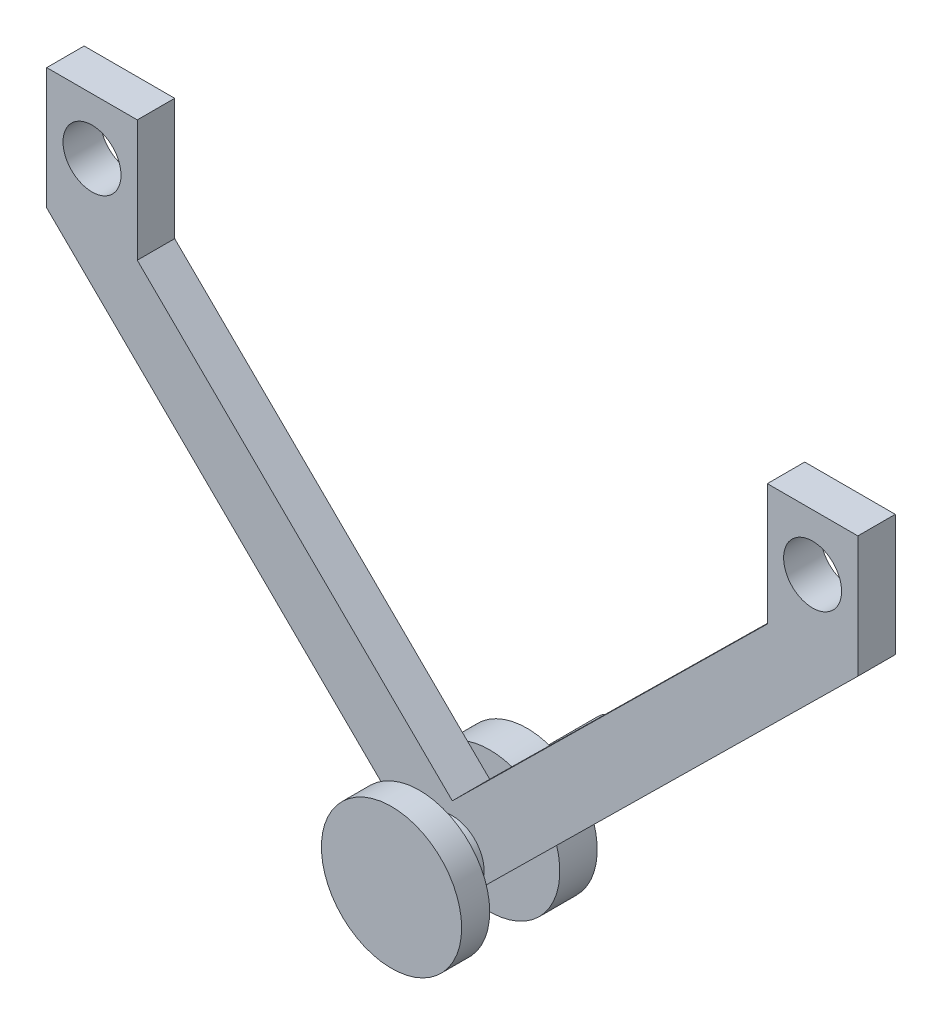
ISO-10303-21;
HEADER;
FILE_DESCRIPTION(('STEP AP214'),'2;1');
FILE_NAME('part.step','',(''),(''),'','','');
FILE_SCHEMA(('AUTOMOTIVE_DESIGN { 1 0 10303 214 1 1 1 1 }'));
ENDSEC;
DATA;
#1=APPLICATION_CONTEXT('core data for automotive mechanical design processes');
#2=APPLICATION_PROTOCOL_DEFINITION('international standard','automotive_design',2000,#1);
#3=PRODUCT_CONTEXT('',#1,'mechanical');
#4=PRODUCT('Part','Part','',(#3));
#5=PRODUCT_RELATED_PRODUCT_CATEGORY('part','',(#4));
#6=PRODUCT_DEFINITION_FORMATION('','',#4);
#7=PRODUCT_DEFINITION_CONTEXT('part definition',#1,'design');
#8=PRODUCT_DEFINITION('design','',#6,#7);
#9=PRODUCT_DEFINITION_SHAPE('','',#8);
#10=(LENGTH_UNIT() NAMED_UNIT(*) SI_UNIT(.MILLI.,.METRE.));
#11=(NAMED_UNIT(*) PLANE_ANGLE_UNIT() SI_UNIT($,.RADIAN.));
#12=(NAMED_UNIT(*) SI_UNIT($,.STERADIAN.) SOLID_ANGLE_UNIT());
#13=UNCERTAINTY_MEASURE_WITH_UNIT(LENGTH_MEASURE(1.E-05),#10,'distance_accuracy_value','');
#14=(GEOMETRIC_REPRESENTATION_CONTEXT(3) GLOBAL_UNCERTAINTY_ASSIGNED_CONTEXT((#13)) GLOBAL_UNIT_ASSIGNED_CONTEXT((#10,
#11,#12)) REPRESENTATION_CONTEXT('',''));
#15=CARTESIAN_POINT('',(0.,0.,0.));
#16=DIRECTION('',(0.,0.,1.));
#17=DIRECTION('',(1.,0.,0.));
#18=AXIS2_PLACEMENT_3D('',#15,#16,#17);
#19=CARTESIAN_POINT('',(0.,0.,-10.5));
#20=DIRECTION('',(0.,0.,-1.));
#21=DIRECTION('',(-1.,0.,0.));
#22=AXIS2_PLACEMENT_3D('',#19,#20,#21);
#23=PLANE('',#22);
#24=DIRECTION('',(0.712012665431887,-0.702166621440083,0.));
#25=VECTOR('',#24,1.);
#26=CARTESIAN_POINT('',(-2.38736651289628,-2.42084306246841,-10.5));
#27=LINE('',#26,#25);
#28=CARTESIAN_POINT('',(-7.14721245336703,2.27318150318781,-10.5));
#29=VERTEX_POINT('',#28);
#30=CARTESIAN_POINT('',(-2.38736651289628,-2.42084306246841,-10.5));
#31=VERTEX_POINT('',#30);
#32=EDGE_CURVE('E55',#29,#31,#27,.T.);
#33=ORIENTED_EDGE('',*,*,#32,.F.);
#34=CARTESIAN_POINT('',(0.,0.,-10.5));
#35=DIRECTION('',(0.,0.,-1.));
#36=DIRECTION('',(-1.,0.,0.));
#37=AXIS2_PLACEMENT_3D('',#34,#35,#36);
#38=CIRCLE('',#37,7.5);
#39=CARTESIAN_POINT('',(7.14721245336703,2.27318150318781,-10.5));
#40=VERTEX_POINT('',#39);
#41=EDGE_CURVE('E189',#40,#29,#38,.T.);
#42=ORIENTED_EDGE('',*,*,#41,.F.);
#43=DIRECTION('',(0.712012665431887,0.702166621440082,0.));
#44=VECTOR('',#43,1.);
#45=CARTESIAN_POINT('',(2.38736651289628,-2.42084306246841,-10.5));
#46=LINE('',#45,#44);
#47=CARTESIAN_POINT('',(2.38736651289628,-2.42084306246841,-10.5));
#48=VERTEX_POINT('',#47);
#49=EDGE_CURVE('E288',#48,#40,#46,.T.);
#50=ORIENTED_EDGE('',*,*,#49,.F.);
#51=CARTESIAN_POINT('',(0.,0.,-10.5));
#52=DIRECTION('',(0.,0.,-1.));
#53=DIRECTION('',(-1.,0.,0.));
#54=AXIS2_PLACEMENT_3D('',#51,#52,#53);
#55=CIRCLE('',#54,3.4);
#56=EDGE_CURVE('E183',#48,#31,#55,.T.);
#57=ORIENTED_EDGE('',*,*,#56,.T.);
#58=EDGE_LOOP('',(#33,#42,#50,#57));
#59=FACE_BOUND('',#58,.T.);
#60=ADVANCED_FACE('F45',(#59),#23,.F.);
#61=DIRECTION('',(-0.712012665431887,-0.702166621440083,0.));
#62=VECTOR('',#61,1.);
#63=CARTESIAN_POINT('',(-2.38736651289628,2.42084306246842,-10.5));
#64=LINE('',#63,#62);
#65=CARTESIAN_POINT('',(2.37247942757447,7.11486762812464,-10.5));
#66=VERTEX_POINT('',#65);
#67=CARTESIAN_POINT('',(0.,4.77519595516979,-10.5));
#68=VERTEX_POINT('',#67);
#69=EDGE_CURVE('E182',#66,#68,#64,.T.);
#70=ORIENTED_EDGE('',*,*,#69,.F.);
#71=CARTESIAN_POINT('',(-2.37247942757447,7.11486762812464,-10.5));
#72=VERTEX_POINT('',#71);
#73=EDGE_CURVE('E188',#72,#66,#38,.T.);
#74=ORIENTED_EDGE('',*,*,#73,.F.);
#75=DIRECTION('',(-0.712012665431887,0.702166621440082,0.));
#76=VECTOR('',#75,1.);
#77=CARTESIAN_POINT('',(0.,4.77519595516979,-10.5));
#78=LINE('',#77,#76);
#79=EDGE_CURVE('E241',#68,#72,#78,.T.);
#80=ORIENTED_EDGE('',*,*,#79,.F.);
#81=EDGE_LOOP('',(#70,#74,#80));
#82=FACE_BOUND('',#81,.T.);
#83=ADVANCED_FACE('F346',(#82),#23,.F.);
#84=CARTESIAN_POINT('',(0.,0.,-14.5));
#85=DIRECTION('',(0.,0.,1.));
#86=DIRECTION('',(1.,0.,0.));
#87=AXIS2_PLACEMENT_3D('',#84,#85,#86);
#88=CYLINDRICAL_SURFACE('',#87,3.4);
#89=CARTESIAN_POINT('',(0.,0.,-6.5));
#90=DIRECTION('',(0.,0.,1.));
#91=DIRECTION('',(1.,0.,0.));
#92=AXIS2_PLACEMENT_3D('',#89,#90,#91);
#93=CIRCLE('',#92,3.4);
#94=CARTESIAN_POINT('',(2.38736651289628,-2.42084306246841,-6.5));
#95=VERTEX_POINT('',#94);
#96=CARTESIAN_POINT('',(-2.38736651289628,-2.42084306246841,-6.5));
#97=VERTEX_POINT('',#96);
#98=EDGE_CURVE('E11',#95,#97,#93,.T.);
#99=ORIENTED_EDGE('',*,*,#98,.T.);
#100=DIRECTION('',(0.,0.,-1.));
#101=VECTOR('',#100,1.);
#102=CARTESIAN_POINT('',(-2.38736651289628,-2.42084306246841,-6.5));
#103=LINE('',#102,#101);
#104=EDGE_CURVE('E174',#97,#31,#103,.T.);
#105=ORIENTED_EDGE('',*,*,#104,.T.);
#106=ORIENTED_EDGE('',*,*,#56,.F.);
#107=DIRECTION('',(0.,0.,-1.));
#108=VECTOR('',#107,1.);
#109=CARTESIAN_POINT('',(2.38736651289628,-2.42084306246841,-6.5));
#110=LINE('',#109,#108);
#111=EDGE_CURVE('E65',#95,#48,#110,.T.);
#112=ORIENTED_EDGE('',*,*,#111,.F.);
#113=EDGE_LOOP('',(#99,#105,#106,#112));
#114=FACE_BOUND('',#113,.T.);
#115=CARTESIAN_POINT('',(0.,0.,-3.));
#116=DIRECTION('',(0.,0.,-1.));
#117=DIRECTION('',(-1.,0.,0.));
#118=AXIS2_PLACEMENT_3D('',#115,#116,#117);
#119=CIRCLE('',#118,3.4);
#120=CARTESIAN_POINT('',(-3.4,0.,-3.));
#121=VERTEX_POINT('',#120);
#122=EDGE_CURVE('E193',#121,#121,#119,.T.);
#123=ORIENTED_EDGE('',*,*,#122,.T.);
#124=EDGE_LOOP('',(#123));
#125=FACE_BOUND('',#124,.T.);
#126=ADVANCED_FACE('F282',(#114,#125),#88,.T.);
#127=CARTESIAN_POINT('',(0.,0.,-3.));
#128=DIRECTION('',(0.,0.,1.));
#129=DIRECTION('',(1.,0.,0.));
#130=AXIS2_PLACEMENT_3D('',#127,#128,#129);
#131=CYLINDRICAL_SURFACE('',#130,7.5);
#132=CARTESIAN_POINT('',(0.,0.,-3.));
#133=DIRECTION('',(0.,0.,1.));
#134=DIRECTION('',(1.,0.,0.));
#135=AXIS2_PLACEMENT_3D('',#132,#133,#134);
#136=CIRCLE('',#135,7.5);
#137=CARTESIAN_POINT('',(7.5,0.,-3.));
#138=VERTEX_POINT('',#137);
#139=EDGE_CURVE('E197',#138,#138,#136,.T.);
#140=ORIENTED_EDGE('',*,*,#139,.T.);
#141=EDGE_LOOP('',(#140));
#142=FACE_BOUND('',#141,.T.);
#143=CARTESIAN_POINT('',(0.,0.,0.));
#144=DIRECTION('',(0.,0.,1.));
#145=DIRECTION('',(1.,0.,0.));
#146=AXIS2_PLACEMENT_3D('',#143,#144,#145);
#147=CIRCLE('',#146,7.5);
#148=CARTESIAN_POINT('',(7.5,0.,0.));
#149=VERTEX_POINT('',#148);
#150=EDGE_CURVE('E187',#149,#149,#147,.T.);
#151=ORIENTED_EDGE('',*,*,#150,.F.);
#152=EDGE_LOOP('',(#151));
#153=FACE_BOUND('',#152,.T.);
#154=ADVANCED_FACE('F47',(#142,#153),#131,.T.);
#155=CARTESIAN_POINT('',(0.,0.,-3.));
#156=DIRECTION('',(0.,0.,1.));
#157=DIRECTION('',(1.,0.,0.));
#158=AXIS2_PLACEMENT_3D('',#155,#156,#157);
#159=PLANE('',#158);
#160=ORIENTED_EDGE('',*,*,#122,.F.);
#161=EDGE_LOOP('',(#160));
#162=FACE_BOUND('',#161,.T.);
#163=ORIENTED_EDGE('',*,*,#139,.F.);
#164=EDGE_LOOP('',(#163));
#165=FACE_BOUND('',#164,.T.);
#166=ADVANCED_FACE('F365',(#162,#165),#159,.F.);
#167=CARTESIAN_POINT('',(0.,0.,0.));
#168=DIRECTION('',(0.,0.,1.));
#169=DIRECTION('',(1.,0.,0.));
#170=AXIS2_PLACEMENT_3D('',#167,#168,#169);
#171=PLANE('',#170);
#172=ORIENTED_EDGE('',*,*,#150,.T.);
#173=EDGE_LOOP('',(#172));
#174=FACE_BOUND('',#173,.T.);
#175=ADVANCED_FACE('F361',(#174),#171,.T.);
#176=CARTESIAN_POINT('',(0.,0.,-10.5));
#177=DIRECTION('',(0.,0.,-1.));
#178=DIRECTION('',(-1.,0.,0.));
#179=AXIS2_PLACEMENT_3D('',#176,#177,#178);
#180=CYLINDRICAL_SURFACE('',#179,7.5);
#181=EDGE_CURVE('E184',#29,#72,#38,.T.);
#182=ORIENTED_EDGE('',*,*,#181,.T.);
#183=ORIENTED_EDGE('',*,*,#73,.T.);
#184=EDGE_CURVE('E228',#66,#40,#38,.T.);
#185=ORIENTED_EDGE('',*,*,#184,.T.);
#186=ORIENTED_EDGE('',*,*,#41,.T.);
#187=EDGE_LOOP('',(#182,#183,#185,#186));
#188=FACE_BOUND('',#187,.T.);
#189=CARTESIAN_POINT('',(0.,0.,-14.5));
#190=DIRECTION('',(0.,0.,-1.));
#191=DIRECTION('',(-1.,0.,0.));
#192=AXIS2_PLACEMENT_3D('',#189,#190,#191);
#193=CIRCLE('',#192,7.5);
#194=CARTESIAN_POINT('',(-7.5,0.,-14.5));
#195=VERTEX_POINT('',#194);
#196=EDGE_CURVE('E172',#195,#195,#193,.T.);
#197=ORIENTED_EDGE('',*,*,#196,.F.);
#198=EDGE_LOOP('',(#197));
#199=FACE_BOUND('',#198,.T.);
#200=ADVANCED_FACE('F223',(#188,#199),#180,.T.);
#201=CARTESIAN_POINT('',(0.,0.,-14.5));
#202=DIRECTION('',(0.,0.,-1.));
#203=DIRECTION('',(-1.,0.,0.));
#204=AXIS2_PLACEMENT_3D('',#201,#202,#203);
#205=PLANE('',#204);
#206=CARTESIAN_POINT('',(0.,0.,-14.5));
#207=DIRECTION('',(0.,0.,-1.));
#208=DIRECTION('',(-1.,0.,0.));
#209=AXIS2_PLACEMENT_3D('',#206,#207,#208);
#210=CIRCLE('',#209,3.4);
#211=CARTESIAN_POINT('',(-3.4,0.,-14.5));
#212=VERTEX_POINT('',#211);
#213=EDGE_CURVE('E178',#212,#212,#210,.T.);
#214=ORIENTED_EDGE('',*,*,#213,.F.);
#215=EDGE_LOOP('',(#214));
#216=FACE_BOUND('',#215,.T.);
#217=ORIENTED_EDGE('',*,*,#196,.T.);
#218=EDGE_LOOP('',(#217));
#219=FACE_BOUND('',#218,.T.);
#220=ADVANCED_FACE('F360',(#216,#219),#205,.T.);
#221=CARTESIAN_POINT('',(0.,0.,-24.5));
#222=DIRECTION('',(0.,0.,1.));
#223=DIRECTION('',(1.,0.,0.));
#224=AXIS2_PLACEMENT_3D('',#221,#222,#223);
#225=CYLINDRICAL_SURFACE('',#224,3.4);
#226=CARTESIAN_POINT('',(0.,0.,-24.5));
#227=DIRECTION('',(0.,0.,-1.));
#228=DIRECTION('',(-1.,0.,0.));
#229=AXIS2_PLACEMENT_3D('',#226,#227,#228);
#230=CIRCLE('',#229,3.4);
#231=CARTESIAN_POINT('',(-3.4,0.,-24.5));
#232=VERTEX_POINT('',#231);
#233=EDGE_CURVE('E167',#232,#232,#230,.T.);
#234=ORIENTED_EDGE('',*,*,#233,.F.);
#235=EDGE_LOOP('',(#234));
#236=FACE_BOUND('',#235,.T.);
#237=ORIENTED_EDGE('',*,*,#213,.T.);
#238=EDGE_LOOP('',(#237));
#239=FACE_BOUND('',#238,.T.);
#240=ADVANCED_FACE('F356',(#236,#239),#225,.T.);
#241=CARTESIAN_POINT('',(0.,0.,-24.5));
#242=DIRECTION('',(0.,0.,-1.));
#243=DIRECTION('',(-1.,0.,0.));
#244=AXIS2_PLACEMENT_3D('',#241,#242,#243);
#245=PLANE('',#244);
#246=ORIENTED_EDGE('',*,*,#233,.T.);
#247=EDGE_LOOP('',(#246));
#248=FACE_BOUND('',#247,.T.);
#249=ADVANCED_FACE('F498',(#248),#245,.T.);
#250=CARTESIAN_POINT('',(0.,0.,-10.5));
#251=DIRECTION('',(0.,0.,1.));
#252=DIRECTION('',(1.,0.,0.));
#253=AXIS2_PLACEMENT_3D('',#250,#251,#252);
#254=PLANE('',#253);
#255=CARTESIAN_POINT('',(-38.5328502669654,45.,-10.5));
#256=DIRECTION('',(0.,0.,-1.));
#257=DIRECTION('',(-1.,0.,0.));
#258=AXIS2_PLACEMENT_3D('',#255,#256,#257);
#259=CIRCLE('',#258,3.1);
#260=CARTESIAN_POINT('',(-41.6328502669654,45.,-10.5));
#261=VERTEX_POINT('',#260);
#262=EDGE_CURVE('E585',#261,#261,#259,.T.);
#263=ORIENTED_EDGE('',*,*,#262,.F.);
#264=EDGE_LOOP('',(#263));
#265=FACE_BOUND('',#264,.T.);
#266=ORIENTED_EDGE('',*,*,#181,.F.);
#267=DIRECTION('',(0.712012665431887,-0.702166621440082,0.));
#268=VECTOR('',#267,1.);
#269=CARTESIAN_POINT('',(-2.38736651289628,-2.42084306246841,-10.5));
#270=LINE('',#269,#268);
#271=CARTESIAN_POINT('',(-43.375005812649,38.,-10.5));
#272=VERTEX_POINT('',#271);
#273=EDGE_CURVE('E217',#272,#29,#270,.T.);
#274=ORIENTED_EDGE('',*,*,#273,.F.);
#275=DIRECTION('',(0.,-1.,0.));
#276=VECTOR('',#275,1.);
#277=CARTESIAN_POINT('',(-43.375005812649,38.,-10.5));
#278=LINE('',#277,#276);
#279=CARTESIAN_POINT('',(-43.375005812649,51.,-10.5));
#280=VERTEX_POINT('',#279);
#281=EDGE_CURVE('E316',#280,#272,#278,.T.);
#282=ORIENTED_EDGE('',*,*,#281,.F.);
#283=DIRECTION('',(-1.,0.,0.));
#284=VECTOR('',#283,1.);
#285=CARTESIAN_POINT('',(-43.375005812649,51.,-10.5));
#286=LINE('',#285,#284);
#287=CARTESIAN_POINT('',(-33.6906947212818,51.,-10.5));
#288=VERTEX_POINT('',#287);
#289=EDGE_CURVE('E165',#288,#280,#286,.T.);
#290=ORIENTED_EDGE('',*,*,#289,.F.);
#291=DIRECTION('',(0.,1.,0.));
#292=VECTOR('',#291,1.);
#293=CARTESIAN_POINT('',(-33.6906947212818,51.,-10.5));
#294=LINE('',#293,#292);
#295=CARTESIAN_POINT('',(-33.6906947212818,38.,-10.5));
#296=VERTEX_POINT('',#295);
#297=EDGE_CURVE('E161',#296,#288,#294,.T.);
#298=ORIENTED_EDGE('',*,*,#297,.F.);
#299=EDGE_CURVE('E235',#72,#296,#78,.T.);
#300=ORIENTED_EDGE('',*,*,#299,.F.);
#301=EDGE_LOOP('',(#266,#274,#282,#290,#298,#300));
#302=FACE_BOUND('',#301,.T.);
#303=ADVANCED_FACE('F233',(#265,#302),#254,.F.);
#304=CARTESIAN_POINT('',(-43.375005812649,51.,-6.5));
#305=DIRECTION('',(0.,-1.,0.));
#306=DIRECTION('',(0.,0.,-1.));
#307=AXIS2_PLACEMENT_3D('',#304,#305,#306);
#308=PLANE('',#307);
#309=ORIENTED_EDGE('',*,*,#289,.T.);
#310=DIRECTION('',(0.,0.,-1.));
#311=VECTOR('',#310,1.);
#312=CARTESIAN_POINT('',(-43.375005812649,51.,-6.5));
#313=LINE('',#312,#311);
#314=CARTESIAN_POINT('',(-43.375005812649,51.,-6.5));
#315=VERTEX_POINT('',#314);
#316=EDGE_CURVE('E143',#315,#280,#313,.T.);
#317=ORIENTED_EDGE('',*,*,#316,.F.);
#318=DIRECTION('',(-1.,0.,0.));
#319=VECTOR('',#318,1.);
#320=CARTESIAN_POINT('',(-43.375005812649,51.,-6.5));
#321=LINE('',#320,#319);
#322=CARTESIAN_POINT('',(-33.6906947212818,51.,-6.5));
#323=VERTEX_POINT('',#322);
#324=EDGE_CURVE('E151',#323,#315,#321,.T.);
#325=ORIENTED_EDGE('',*,*,#324,.F.);
#326=DIRECTION('',(0.,0.,-1.));
#327=VECTOR('',#326,1.);
#328=CARTESIAN_POINT('',(-33.6906947212818,51.,-6.5));
#329=LINE('',#328,#327);
#330=EDGE_CURVE('E256',#323,#288,#329,.T.);
#331=ORIENTED_EDGE('',*,*,#330,.T.);
#332=EDGE_LOOP('',(#309,#317,#325,#331));
#333=FACE_BOUND('',#332,.T.);
#334=ADVANCED_FACE('F163',(#333),#308,.F.);
#335=CARTESIAN_POINT('',(-43.375005812649,38.,-6.5));
#336=DIRECTION('',(1.,0.,0.));
#337=DIRECTION('',(0.,0.,-1.));
#338=AXIS2_PLACEMENT_3D('',#335,#336,#337);
#339=PLANE('',#338);
#340=ORIENTED_EDGE('',*,*,#281,.T.);
#341=DIRECTION('',(0.,0.,-1.));
#342=VECTOR('',#341,1.);
#343=CARTESIAN_POINT('',(-43.375005812649,38.,-6.5));
#344=LINE('',#343,#342);
#345=CARTESIAN_POINT('',(-43.375005812649,38.,-6.5));
#346=VERTEX_POINT('',#345);
#347=EDGE_CURVE('E146',#346,#272,#344,.T.);
#348=ORIENTED_EDGE('',*,*,#347,.F.);
#349=DIRECTION('',(0.,-1.,0.));
#350=VECTOR('',#349,1.);
#351=CARTESIAN_POINT('',(-43.375005812649,38.,-6.5));
#352=LINE('',#351,#350);
#353=EDGE_CURVE('E139',#315,#346,#352,.T.);
#354=ORIENTED_EDGE('',*,*,#353,.F.);
#355=ORIENTED_EDGE('',*,*,#316,.T.);
#356=EDGE_LOOP('',(#340,#348,#354,#355));
#357=FACE_BOUND('',#356,.T.);
#358=ADVANCED_FACE('F141',(#357),#339,.F.);
#359=CARTESIAN_POINT('',(-2.38736651289628,-2.42084306246841,-6.5));
#360=DIRECTION('',(0.702166621440083,0.712012665431887,0.));
#361=DIRECTION('',(-0.712012665431887,0.702166621440083,0.));
#362=AXIS2_PLACEMENT_3D('',#359,#360,#361);
#363=PLANE('',#362);
#364=ORIENTED_EDGE('',*,*,#273,.T.);
#365=ORIENTED_EDGE('',*,*,#32,.T.);
#366=ORIENTED_EDGE('',*,*,#104,.F.);
#367=DIRECTION('',(0.712012665431887,-0.702166621440082,0.));
#368=VECTOR('',#367,1.);
#369=CARTESIAN_POINT('',(-2.38736651289628,-2.42084306246841,-6.5));
#370=LINE('',#369,#368);
#371=EDGE_CURVE('E150',#346,#97,#370,.T.);
#372=ORIENTED_EDGE('',*,*,#371,.F.);
#373=ORIENTED_EDGE('',*,*,#347,.T.);
#374=EDGE_LOOP('',(#364,#365,#366,#372,#373));
#375=FACE_BOUND('',#374,.T.);
#376=ADVANCED_FACE('F215',(#375),#363,.F.);
#377=CARTESIAN_POINT('',(2.38736651289628,-2.42084306246841,-6.5));
#378=DIRECTION('',(-0.702166621440083,0.712012665431887,0.));
#379=DIRECTION('',(-0.712012665431887,-0.702166621440083,0.));
#380=AXIS2_PLACEMENT_3D('',#377,#378,#379);
#381=PLANE('',#380);
#382=ORIENTED_EDGE('',*,*,#49,.T.);
#383=CARTESIAN_POINT('',(43.375005812649,38.,-10.5));
#384=VERTEX_POINT('',#383);
#385=EDGE_CURVE('E321',#40,#384,#46,.T.);
#386=ORIENTED_EDGE('',*,*,#385,.T.);
#387=DIRECTION('',(0.,0.,-1.));
#388=VECTOR('',#387,1.);
#389=CARTESIAN_POINT('',(43.375005812649,38.,-6.5));
#390=LINE('',#389,#388);
#391=CARTESIAN_POINT('',(43.375005812649,38.,-6.5));
#392=VERTEX_POINT('',#391);
#393=EDGE_CURVE('E276',#392,#384,#390,.T.);
#394=ORIENTED_EDGE('',*,*,#393,.F.);
#395=DIRECTION('',(0.712012665431887,0.702166621440082,0.));
#396=VECTOR('',#395,1.);
#397=CARTESIAN_POINT('',(2.38736651289628,-2.42084306246841,-6.5));
#398=LINE('',#397,#396);
#399=EDGE_CURVE('E290',#95,#392,#398,.T.);
#400=ORIENTED_EDGE('',*,*,#399,.F.);
#401=ORIENTED_EDGE('',*,*,#111,.T.);
#402=EDGE_LOOP('',(#382,#386,#394,#400,#401));
#403=FACE_BOUND('',#402,.T.);
#404=ADVANCED_FACE('F287',(#403),#381,.F.);
#405=CARTESIAN_POINT('',(43.375005812649,38.,-6.5));
#406=DIRECTION('',(-1.,0.,0.));
#407=DIRECTION('',(0.,0.,1.));
#408=AXIS2_PLACEMENT_3D('',#405,#406,#407);
#409=PLANE('',#408);
#410=DIRECTION('',(0.,1.,0.));
#411=VECTOR('',#410,1.);
#412=CARTESIAN_POINT('',(43.375005812649,38.,-10.5));
#413=LINE('',#412,#411);
#414=CARTESIAN_POINT('',(43.375005812649,51.,-10.5));
#415=VERTEX_POINT('',#414);
#416=EDGE_CURVE('E324',#384,#415,#413,.T.);
#417=ORIENTED_EDGE('',*,*,#416,.T.);
#418=DIRECTION('',(0.,0.,-1.));
#419=VECTOR('',#418,1.);
#420=CARTESIAN_POINT('',(43.375005812649,51.,-6.5));
#421=LINE('',#420,#419);
#422=CARTESIAN_POINT('',(43.375005812649,51.,-6.5));
#423=VERTEX_POINT('',#422);
#424=EDGE_CURVE('E272',#423,#415,#421,.T.);
#425=ORIENTED_EDGE('',*,*,#424,.F.);
#426=DIRECTION('',(0.,1.,0.));
#427=VECTOR('',#426,1.);
#428=CARTESIAN_POINT('',(43.375005812649,38.,-6.5));
#429=LINE('',#428,#427);
#430=EDGE_CURVE('E293',#392,#423,#429,.T.);
#431=ORIENTED_EDGE('',*,*,#430,.F.);
#432=ORIENTED_EDGE('',*,*,#393,.T.);
#433=EDGE_LOOP('',(#417,#425,#431,#432));
#434=FACE_BOUND('',#433,.T.);
#435=ADVANCED_FACE('F442',(#434),#409,.F.);
#436=CARTESIAN_POINT('',(43.375005812649,51.,-6.5));
#437=DIRECTION('',(0.,-1.,0.));
#438=DIRECTION('',(0.,0.,-1.));
#439=AXIS2_PLACEMENT_3D('',#436,#437,#438);
#440=PLANE('',#439);
#441=DIRECTION('',(-1.,0.,0.));
#442=VECTOR('',#441,1.);
#443=CARTESIAN_POINT('',(43.375005812649,51.,-10.5));
#444=LINE('',#443,#442);
#445=CARTESIAN_POINT('',(33.6906947212818,51.,-10.5));
#446=VERTEX_POINT('',#445);
#447=EDGE_CURVE('E327',#415,#446,#444,.T.);
#448=ORIENTED_EDGE('',*,*,#447,.T.);
#449=DIRECTION('',(0.,0.,-1.));
#450=VECTOR('',#449,1.);
#451=CARTESIAN_POINT('',(33.6906947212818,51.,-6.5));
#452=LINE('',#451,#450);
#453=CARTESIAN_POINT('',(33.6906947212818,51.,-6.5));
#454=VERTEX_POINT('',#453);
#455=EDGE_CURVE('E268',#454,#446,#452,.T.);
#456=ORIENTED_EDGE('',*,*,#455,.F.);
#457=DIRECTION('',(-1.,0.,0.));
#458=VECTOR('',#457,1.);
#459=CARTESIAN_POINT('',(43.375005812649,51.,-6.5));
#460=LINE('',#459,#458);
#461=EDGE_CURVE('E297',#423,#454,#460,.T.);
#462=ORIENTED_EDGE('',*,*,#461,.F.);
#463=ORIENTED_EDGE('',*,*,#424,.T.);
#464=EDGE_LOOP('',(#448,#456,#462,#463));
#465=FACE_BOUND('',#464,.T.);
#466=ADVANCED_FACE('F450',(#465),#440,.F.);
#467=CARTESIAN_POINT('',(33.6906947212818,51.,-6.5));
#468=DIRECTION('',(1.,0.,0.));
#469=DIRECTION('',(0.,1.,0.));
#470=AXIS2_PLACEMENT_3D('',#467,#468,#469);
#471=PLANE('',#470);
#472=DIRECTION('',(0.,-1.,0.));
#473=VECTOR('',#472,1.);
#474=CARTESIAN_POINT('',(33.6906947212818,51.,-10.5));
#475=LINE('',#474,#473);
#476=CARTESIAN_POINT('',(33.6906947212818,38.,-10.5));
#477=VERTEX_POINT('',#476);
#478=EDGE_CURVE('E329',#446,#477,#475,.T.);
#479=ORIENTED_EDGE('',*,*,#478,.T.);
#480=DIRECTION('',(0.,0.,-1.));
#481=VECTOR('',#480,1.);
#482=CARTESIAN_POINT('',(33.6906947212818,38.,-6.5));
#483=LINE('',#482,#481);
#484=CARTESIAN_POINT('',(33.6906947212818,38.,-6.5));
#485=VERTEX_POINT('',#484);
#486=EDGE_CURVE('E264',#485,#477,#483,.T.);
#487=ORIENTED_EDGE('',*,*,#486,.F.);
#488=DIRECTION('',(0.,-1.,0.));
#489=VECTOR('',#488,1.);
#490=CARTESIAN_POINT('',(33.6906947212818,51.,-6.5));
#491=LINE('',#490,#489);
#492=EDGE_CURVE('E303',#454,#485,#491,.T.);
#493=ORIENTED_EDGE('',*,*,#492,.F.);
#494=ORIENTED_EDGE('',*,*,#455,.T.);
#495=EDGE_LOOP('',(#479,#487,#493,#494));
#496=FACE_BOUND('',#495,.T.);
#497=ADVANCED_FACE('F459',(#496),#471,.F.);
#498=CARTESIAN_POINT('',(0.,4.77519595516979,-6.5));
#499=DIRECTION('',(0.702166621440083,-0.712012665431887,0.));
#500=DIRECTION('',(0.712012665431887,0.702166621440083,0.));
#501=AXIS2_PLACEMENT_3D('',#498,#499,#500);
#502=PLANE('',#501);
#503=DIRECTION('',(-0.712012665431887,-0.702166621440082,0.));
#504=VECTOR('',#503,1.);
#505=CARTESIAN_POINT('',(0.,4.77519595516979,-10.5));
#506=LINE('',#505,#504);
#507=EDGE_CURVE('E242',#477,#66,#506,.T.);
#508=ORIENTED_EDGE('',*,*,#507,.T.);
#509=ORIENTED_EDGE('',*,*,#69,.T.);
#510=DIRECTION('',(0.,0.,-1.));
#511=VECTOR('',#510,1.);
#512=CARTESIAN_POINT('',(0.,4.77519595516979,-6.5));
#513=LINE('',#512,#511);
#514=CARTESIAN_POINT('',(0.,4.77519595516979,-6.5));
#515=VERTEX_POINT('',#514);
#516=EDGE_CURVE('E248',#515,#68,#513,.T.);
#517=ORIENTED_EDGE('',*,*,#516,.F.);
#518=DIRECTION('',(-0.712012665431887,-0.702166621440082,0.));
#519=VECTOR('',#518,1.);
#520=CARTESIAN_POINT('',(0.,4.77519595516979,-6.5));
#521=LINE('',#520,#519);
#522=EDGE_CURVE('E306',#485,#515,#521,.T.);
#523=ORIENTED_EDGE('',*,*,#522,.F.);
#524=ORIENTED_EDGE('',*,*,#486,.T.);
#525=EDGE_LOOP('',(#508,#509,#517,#523,#524));
#526=FACE_BOUND('',#525,.T.);
#527=ADVANCED_FACE('F338',(#526),#502,.F.);
#528=CARTESIAN_POINT('',(0.,4.77519595516979,-6.5));
#529=DIRECTION('',(-0.702166621440083,-0.712012665431887,0.));
#530=DIRECTION('',(0.712012665431887,-0.702166621440083,0.));
#531=AXIS2_PLACEMENT_3D('',#528,#529,#530);
#532=PLANE('',#531);
#533=ORIENTED_EDGE('',*,*,#79,.T.);
#534=ORIENTED_EDGE('',*,*,#299,.T.);
#535=DIRECTION('',(0.,0.,-1.));
#536=VECTOR('',#535,1.);
#537=CARTESIAN_POINT('',(-33.6906947212818,38.,-6.5));
#538=LINE('',#537,#536);
#539=CARTESIAN_POINT('',(-33.6906947212818,38.,-6.5));
#540=VERTEX_POINT('',#539);
#541=EDGE_CURVE('E259',#540,#296,#538,.T.);
#542=ORIENTED_EDGE('',*,*,#541,.F.);
#543=DIRECTION('',(-0.712012665431887,0.702166621440082,0.));
#544=VECTOR('',#543,1.);
#545=CARTESIAN_POINT('',(0.,4.77519595516979,-6.5));
#546=LINE('',#545,#544);
#547=EDGE_CURVE('E309',#515,#540,#546,.T.);
#548=ORIENTED_EDGE('',*,*,#547,.F.);
#549=ORIENTED_EDGE('',*,*,#516,.T.);
#550=EDGE_LOOP('',(#533,#534,#542,#548,#549));
#551=FACE_BOUND('',#550,.T.);
#552=ADVANCED_FACE('F245',(#551),#532,.F.);
#553=CARTESIAN_POINT('',(-33.6906947212818,51.,-6.5));
#554=DIRECTION('',(-1.,0.,0.));
#555=DIRECTION('',(0.,-1.,0.));
#556=AXIS2_PLACEMENT_3D('',#553,#554,#555);
#557=PLANE('',#556);
#558=ORIENTED_EDGE('',*,*,#297,.T.);
#559=ORIENTED_EDGE('',*,*,#330,.F.);
#560=DIRECTION('',(0.,1.,0.));
#561=VECTOR('',#560,1.);
#562=CARTESIAN_POINT('',(-33.6906947212818,51.,-6.5));
#563=LINE('',#562,#561);
#564=EDGE_CURVE('E156',#540,#323,#563,.T.);
#565=ORIENTED_EDGE('',*,*,#564,.F.);
#566=ORIENTED_EDGE('',*,*,#541,.T.);
#567=EDGE_LOOP('',(#558,#559,#565,#566));
#568=FACE_BOUND('',#567,.T.);
#569=ADVANCED_FACE('F482',(#568),#557,.F.);
#570=CARTESIAN_POINT('',(0.,0.,-6.5));
#571=DIRECTION('',(0.,0.,1.));
#572=DIRECTION('',(1.,0.,0.));
#573=AXIS2_PLACEMENT_3D('',#570,#571,#572);
#574=PLANE('',#573);
#575=CARTESIAN_POINT('',(38.5328502669654,45.,-6.5));
#576=DIRECTION('',(0.,0.,1.));
#577=DIRECTION('',(1.,0.,0.));
#578=AXIS2_PLACEMENT_3D('',#575,#576,#577);
#579=CIRCLE('',#578,3.1);
#580=CARTESIAN_POINT('',(41.6328502669654,45.,-6.5));
#581=VERTEX_POINT('',#580);
#582=EDGE_CURVE('E591',#581,#581,#579,.T.);
#583=ORIENTED_EDGE('',*,*,#582,.F.);
#584=EDGE_LOOP('',(#583));
#585=FACE_BOUND('',#584,.T.);
#586=CARTESIAN_POINT('',(-38.5328502669654,45.,-6.5));
#587=DIRECTION('',(0.,0.,1.));
#588=DIRECTION('',(1.,0.,0.));
#589=AXIS2_PLACEMENT_3D('',#586,#587,#588);
#590=CIRCLE('',#589,3.1);
#591=CARTESIAN_POINT('',(-35.4328502669654,45.,-6.5));
#592=VERTEX_POINT('',#591);
#593=EDGE_CURVE('E49',#592,#592,#590,.T.);
#594=ORIENTED_EDGE('',*,*,#593,.F.);
#595=EDGE_LOOP('',(#594));
#596=FACE_BOUND('',#595,.T.);
#597=ORIENTED_EDGE('',*,*,#98,.F.);
#598=ORIENTED_EDGE('',*,*,#399,.T.);
#599=ORIENTED_EDGE('',*,*,#430,.T.);
#600=ORIENTED_EDGE('',*,*,#461,.T.);
#601=ORIENTED_EDGE('',*,*,#492,.T.);
#602=ORIENTED_EDGE('',*,*,#522,.T.);
#603=ORIENTED_EDGE('',*,*,#547,.T.);
#604=ORIENTED_EDGE('',*,*,#564,.T.);
#605=ORIENTED_EDGE('',*,*,#324,.T.);
#606=ORIENTED_EDGE('',*,*,#353,.T.);
#607=ORIENTED_EDGE('',*,*,#371,.T.);
#608=EDGE_LOOP('',(#597,#598,#599,#600,#601,#602,#603,#604,#605,#606,#607));
#609=FACE_BOUND('',#608,.T.);
#610=ADVANCED_FACE('F154',(#585,#596,#609),#574,.T.);
#611=CARTESIAN_POINT('',(38.5328502669654,45.,-10.5));
#612=DIRECTION('',(0.,0.,-1.));
#613=DIRECTION('',(-1.,0.,0.));
#614=AXIS2_PLACEMENT_3D('',#611,#612,#613);
#615=CIRCLE('',#614,3.1);
#616=CARTESIAN_POINT('',(35.4328502669654,45.,-10.5));
#617=VERTEX_POINT('',#616);
#618=EDGE_CURVE('E587',#617,#617,#615,.T.);
#619=ORIENTED_EDGE('',*,*,#618,.F.);
#620=EDGE_LOOP('',(#619));
#621=FACE_BOUND('',#620,.T.);
#622=ORIENTED_EDGE('',*,*,#184,.F.);
#623=ORIENTED_EDGE('',*,*,#507,.F.);
#624=ORIENTED_EDGE('',*,*,#478,.F.);
#625=ORIENTED_EDGE('',*,*,#447,.F.);
#626=ORIENTED_EDGE('',*,*,#416,.F.);
#627=ORIENTED_EDGE('',*,*,#385,.F.);
#628=EDGE_LOOP('',(#622,#623,#624,#625,#626,#627));
#629=FACE_BOUND('',#628,.T.);
#630=ADVANCED_FACE('F341',(#621,#629),#254,.F.);
#631=CARTESIAN_POINT('',(38.5328502669654,45.,0.));
#632=DIRECTION('',(0.,0.,-1.));
#633=DIRECTION('',(-1.,0.,0.));
#634=AXIS2_PLACEMENT_3D('',#631,#632,#633);
#635=CYLINDRICAL_SURFACE('',#634,3.1);
#636=ORIENTED_EDGE('',*,*,#582,.T.);
#637=EDGE_LOOP('',(#636));
#638=FACE_BOUND('',#637,.T.);
#639=ORIENTED_EDGE('',*,*,#618,.T.);
#640=EDGE_LOOP('',(#639));
#641=FACE_BOUND('',#640,.T.);
#642=ADVANCED_FACE('F515',(#638,#641),#635,.F.);
#643=CARTESIAN_POINT('',(-38.5328502669654,45.,0.));
#644=DIRECTION('',(0.,0.,-1.));
#645=DIRECTION('',(-1.,0.,0.));
#646=AXIS2_PLACEMENT_3D('',#643,#644,#645);
#647=CYLINDRICAL_SURFACE('',#646,3.1);
#648=ORIENTED_EDGE('',*,*,#593,.T.);
#649=EDGE_LOOP('',(#648));
#650=FACE_BOUND('',#649,.T.);
#651=ORIENTED_EDGE('',*,*,#262,.T.);
#652=EDGE_LOOP('',(#651));
#653=FACE_BOUND('',#652,.T.);
#654=ADVANCED_FACE('F523',(#650,#653),#647,.F.);
#655=CLOSED_SHELL('',(#60,#83,#126,#154,#166,#175,#200,#220,#240,#249,#303,#334,#358,#376,#404,
#435,#466,#497,#527,#552,#569,#610,#630,#642,#654));
#656=MANIFOLD_SOLID_BREP('B2',#655);
#657=ADVANCED_BREP_SHAPE_REPRESENTATION('',(#18,#656),#14);
#658=SHAPE_DEFINITION_REPRESENTATION(#9,#657);
ENDSEC;
END-ISO-10303-21;
